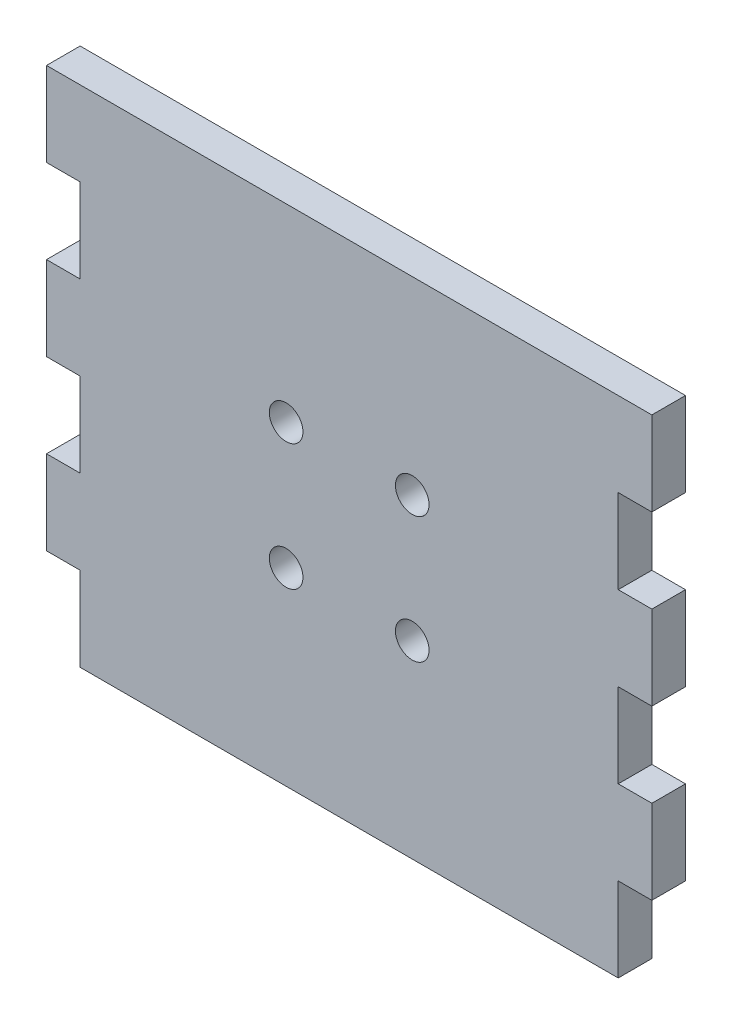
ISO-10303-21;
HEADER;
FILE_DESCRIPTION(('STEP AP214'),'2;1');
FILE_NAME('part.step','',(''),(''),'','','');
FILE_SCHEMA(('AUTOMOTIVE_DESIGN { 1 0 10303 214 1 1 1 1 }'));
ENDSEC;
DATA;
#1=APPLICATION_CONTEXT('core data for automotive mechanical design processes');
#2=APPLICATION_PROTOCOL_DEFINITION('international standard','automotive_design',2000,#1);
#3=PRODUCT_CONTEXT('',#1,'mechanical');
#4=PRODUCT('Part','Part','',(#3));
#5=PRODUCT_RELATED_PRODUCT_CATEGORY('part','',(#4));
#6=PRODUCT_DEFINITION_FORMATION('','',#4);
#7=PRODUCT_DEFINITION_CONTEXT('part definition',#1,'design');
#8=PRODUCT_DEFINITION('design','',#6,#7);
#9=PRODUCT_DEFINITION_SHAPE('','',#8);
#10=(LENGTH_UNIT() NAMED_UNIT(*) SI_UNIT(.MILLI.,.METRE.));
#11=(NAMED_UNIT(*) PLANE_ANGLE_UNIT() SI_UNIT($,.RADIAN.));
#12=(NAMED_UNIT(*) SI_UNIT($,.STERADIAN.) SOLID_ANGLE_UNIT());
#13=UNCERTAINTY_MEASURE_WITH_UNIT(LENGTH_MEASURE(1.E-05),#10,'distance_accuracy_value','');
#14=(GEOMETRIC_REPRESENTATION_CONTEXT(3) GLOBAL_UNCERTAINTY_ASSIGNED_CONTEXT((#13)) GLOBAL_UNIT_ASSIGNED_CONTEXT((#10,
#11,#12)) REPRESENTATION_CONTEXT('',''));
#15=CARTESIAN_POINT('',(0.,0.,0.));
#16=DIRECTION('',(0.,0.,1.));
#17=DIRECTION('',(1.,0.,0.));
#18=AXIS2_PLACEMENT_3D('',#15,#16,#17);
#19=CARTESIAN_POINT('',(0.,0.,4.));
#20=DIRECTION('',(0.,0.,1.));
#21=DIRECTION('',(1.,0.,0.));
#22=AXIS2_PLACEMENT_3D('',#19,#20,#21);
#23=PLANE('',#22);
#24=CARTESIAN_POINT('',(7.5,-7.5,4.));
#25=DIRECTION('',(0.,0.,1.));
#26=DIRECTION('',(1.,0.,0.));
#27=AXIS2_PLACEMENT_3D('',#24,#25,#26);
#28=CIRCLE('',#27,2.);
#29=CARTESIAN_POINT('',(9.5,-7.5,4.));
#30=VERTEX_POINT('',#29);
#31=EDGE_CURVE('E449',#30,#30,#28,.T.);
#32=ORIENTED_EDGE('',*,*,#31,.F.);
#33=EDGE_LOOP('',(#32));
#34=FACE_BOUND('',#33,.T.);
#35=CARTESIAN_POINT('',(-7.5,7.5,4.));
#36=DIRECTION('',(0.,0.,1.));
#37=DIRECTION('',(1.,0.,0.));
#38=AXIS2_PLACEMENT_3D('',#35,#36,#37);
#39=CIRCLE('',#38,2.);
#40=CARTESIAN_POINT('',(-5.5,7.5,4.));
#41=VERTEX_POINT('',#40);
#42=EDGE_CURVE('E232',#41,#41,#39,.T.);
#43=ORIENTED_EDGE('',*,*,#42,.F.);
#44=EDGE_LOOP('',(#43));
#45=FACE_BOUND('',#44,.T.);
#46=DIRECTION('',(0.,-1.,0.));
#47=VECTOR('',#46,1.);
#48=CARTESIAN_POINT('',(-36.,30.,4.));
#49=LINE('',#48,#47);
#50=CARTESIAN_POINT('',(-36.,30.,4.));
#51=VERTEX_POINT('',#50);
#52=CARTESIAN_POINT('',(-36.,20.,4.));
#53=VERTEX_POINT('',#52);
#54=EDGE_CURVE('E275',#51,#53,#49,.T.);
#55=ORIENTED_EDGE('',*,*,#54,.T.);
#56=DIRECTION('',(1.,0.,0.));
#57=VECTOR('',#56,1.);
#58=CARTESIAN_POINT('',(-36.,20.,4.));
#59=LINE('',#58,#57);
#60=CARTESIAN_POINT('',(-32.,20.,4.));
#61=VERTEX_POINT('',#60);
#62=EDGE_CURVE('E143',#53,#61,#59,.T.);
#63=ORIENTED_EDGE('',*,*,#62,.T.);
#64=DIRECTION('',(0.,-1.,0.));
#65=VECTOR('',#64,1.);
#66=CARTESIAN_POINT('',(-32.,20.,4.));
#67=LINE('',#66,#65);
#68=CARTESIAN_POINT('',(-32.,9.99999999999999,4.));
#69=VERTEX_POINT('',#68);
#70=EDGE_CURVE('E338',#61,#69,#67,.T.);
#71=ORIENTED_EDGE('',*,*,#70,.T.);
#72=DIRECTION('',(-1.,0.,0.));
#73=VECTOR('',#72,1.);
#74=CARTESIAN_POINT('',(-32.,9.99999999999999,4.));
#75=LINE('',#74,#73);
#76=CARTESIAN_POINT('',(-36.,9.99999999999999,4.));
#77=VERTEX_POINT('',#76);
#78=EDGE_CURVE('E357',#69,#77,#75,.T.);
#79=ORIENTED_EDGE('',*,*,#78,.T.);
#80=DIRECTION('',(0.,-1.,0.));
#81=VECTOR('',#80,1.);
#82=CARTESIAN_POINT('',(-36.,9.99999999999999,4.));
#83=LINE('',#82,#81);
#84=CARTESIAN_POINT('',(-36.,0.,4.));
#85=VERTEX_POINT('',#84);
#86=EDGE_CURVE('E354',#77,#85,#83,.T.);
#87=ORIENTED_EDGE('',*,*,#86,.T.);
#88=DIRECTION('',(1.,0.,0.));
#89=VECTOR('',#88,1.);
#90=CARTESIAN_POINT('',(-36.,0.,4.));
#91=LINE('',#90,#89);
#92=CARTESIAN_POINT('',(-32.,0.,4.));
#93=VERTEX_POINT('',#92);
#94=EDGE_CURVE('E356',#85,#93,#91,.T.);
#95=ORIENTED_EDGE('',*,*,#94,.T.);
#96=DIRECTION('',(0.,-1.,0.));
#97=VECTOR('',#96,1.);
#98=CARTESIAN_POINT('',(-32.,0.,4.));
#99=LINE('',#98,#97);
#100=CARTESIAN_POINT('',(-32.,-10.,4.));
#101=VERTEX_POINT('',#100);
#102=EDGE_CURVE('E359',#93,#101,#99,.T.);
#103=ORIENTED_EDGE('',*,*,#102,.T.);
#104=DIRECTION('',(-1.,0.,0.));
#105=VECTOR('',#104,1.);
#106=CARTESIAN_POINT('',(-32.,-10.,4.));
#107=LINE('',#106,#105);
#108=CARTESIAN_POINT('',(-36.,-10.,4.));
#109=VERTEX_POINT('',#108);
#110=EDGE_CURVE('E365',#101,#109,#107,.T.);
#111=ORIENTED_EDGE('',*,*,#110,.T.);
#112=DIRECTION('',(0.,-1.,0.));
#113=VECTOR('',#112,1.);
#114=CARTESIAN_POINT('',(-36.,-10.,4.));
#115=LINE('',#114,#113);
#116=CARTESIAN_POINT('',(-36.,-20.,4.));
#117=VERTEX_POINT('',#116);
#118=EDGE_CURVE('E367',#109,#117,#115,.T.);
#119=ORIENTED_EDGE('',*,*,#118,.T.);
#120=DIRECTION('',(1.,0.,0.));
#121=VECTOR('',#120,1.);
#122=CARTESIAN_POINT('',(-36.,-20.,4.));
#123=LINE('',#122,#121);
#124=CARTESIAN_POINT('',(-32.,-20.,4.));
#125=VERTEX_POINT('',#124);
#126=EDGE_CURVE('E369',#117,#125,#123,.T.);
#127=ORIENTED_EDGE('',*,*,#126,.T.);
#128=DIRECTION('',(0.,-1.,0.));
#129=VECTOR('',#128,1.);
#130=CARTESIAN_POINT('',(-32.,-20.,4.));
#131=LINE('',#130,#129);
#132=CARTESIAN_POINT('',(-32.,-30.,4.));
#133=VERTEX_POINT('',#132);
#134=EDGE_CURVE('E371',#125,#133,#131,.T.);
#135=ORIENTED_EDGE('',*,*,#134,.T.);
#136=DIRECTION('',(1.,0.,0.));
#137=VECTOR('',#136,1.);
#138=CARTESIAN_POINT('',(-32.,-30.,4.));
#139=LINE('',#138,#137);
#140=CARTESIAN_POINT('',(32.,-30.,4.));
#141=VERTEX_POINT('',#140);
#142=EDGE_CURVE('E373',#133,#141,#139,.T.);
#143=ORIENTED_EDGE('',*,*,#142,.T.);
#144=DIRECTION('',(0.,1.,0.));
#145=VECTOR('',#144,1.);
#146=CARTESIAN_POINT('',(32.,-20.,4.));
#147=LINE('',#146,#145);
#148=CARTESIAN_POINT('',(32.,-20.,4.));
#149=VERTEX_POINT('',#148);
#150=EDGE_CURVE('E375',#141,#149,#147,.T.);
#151=ORIENTED_EDGE('',*,*,#150,.T.);
#152=DIRECTION('',(1.,0.,0.));
#153=VECTOR('',#152,1.);
#154=CARTESIAN_POINT('',(36.,-20.,4.));
#155=LINE('',#154,#153);
#156=CARTESIAN_POINT('',(36.,-20.,4.));
#157=VERTEX_POINT('',#156);
#158=EDGE_CURVE('E377',#149,#157,#155,.T.);
#159=ORIENTED_EDGE('',*,*,#158,.T.);
#160=DIRECTION('',(0.,1.,0.));
#161=VECTOR('',#160,1.);
#162=CARTESIAN_POINT('',(36.,-10.,4.));
#163=LINE('',#162,#161);
#164=CARTESIAN_POINT('',(36.,-10.,4.));
#165=VERTEX_POINT('',#164);
#166=EDGE_CURVE('E379',#157,#165,#163,.T.);
#167=ORIENTED_EDGE('',*,*,#166,.T.);
#168=DIRECTION('',(-1.,0.,0.));
#169=VECTOR('',#168,1.);
#170=CARTESIAN_POINT('',(32.,-10.,4.));
#171=LINE('',#170,#169);
#172=CARTESIAN_POINT('',(32.,-10.,4.));
#173=VERTEX_POINT('',#172);
#174=EDGE_CURVE('E381',#165,#173,#171,.T.);
#175=ORIENTED_EDGE('',*,*,#174,.T.);
#176=DIRECTION('',(0.,1.,0.));
#177=VECTOR('',#176,1.);
#178=CARTESIAN_POINT('',(32.,0.,4.));
#179=LINE('',#178,#177);
#180=CARTESIAN_POINT('',(32.,0.,4.));
#181=VERTEX_POINT('',#180);
#182=EDGE_CURVE('E383',#173,#181,#179,.T.);
#183=ORIENTED_EDGE('',*,*,#182,.T.);
#184=DIRECTION('',(1.,0.,0.));
#185=VECTOR('',#184,1.);
#186=CARTESIAN_POINT('',(36.,0.,4.));
#187=LINE('',#186,#185);
#188=CARTESIAN_POINT('',(36.,0.,4.));
#189=VERTEX_POINT('',#188);
#190=EDGE_CURVE('E385',#181,#189,#187,.T.);
#191=ORIENTED_EDGE('',*,*,#190,.T.);
#192=DIRECTION('',(0.,1.,0.));
#193=VECTOR('',#192,1.);
#194=CARTESIAN_POINT('',(36.,9.99999999999999,4.));
#195=LINE('',#194,#193);
#196=CARTESIAN_POINT('',(36.,9.99999999999999,4.));
#197=VERTEX_POINT('',#196);
#198=EDGE_CURVE('E387',#189,#197,#195,.T.);
#199=ORIENTED_EDGE('',*,*,#198,.T.);
#200=DIRECTION('',(-1.,0.,0.));
#201=VECTOR('',#200,1.);
#202=CARTESIAN_POINT('',(32.,9.99999999999999,4.));
#203=LINE('',#202,#201);
#204=CARTESIAN_POINT('',(32.,9.99999999999999,4.));
#205=VERTEX_POINT('',#204);
#206=EDGE_CURVE('E389',#197,#205,#203,.T.);
#207=ORIENTED_EDGE('',*,*,#206,.T.);
#208=DIRECTION('',(0.,1.,0.));
#209=VECTOR('',#208,1.);
#210=CARTESIAN_POINT('',(32.,20.,4.));
#211=LINE('',#210,#209);
#212=CARTESIAN_POINT('',(32.,20.,4.));
#213=VERTEX_POINT('',#212);
#214=EDGE_CURVE('E210',#205,#213,#211,.T.);
#215=ORIENTED_EDGE('',*,*,#214,.T.);
#216=DIRECTION('',(1.,0.,0.));
#217=VECTOR('',#216,1.);
#218=CARTESIAN_POINT('',(36.,20.,4.));
#219=LINE('',#218,#217);
#220=CARTESIAN_POINT('',(36.,20.,4.));
#221=VERTEX_POINT('',#220);
#222=EDGE_CURVE('E204',#213,#221,#219,.T.);
#223=ORIENTED_EDGE('',*,*,#222,.T.);
#224=DIRECTION('',(0.,1.,0.));
#225=VECTOR('',#224,1.);
#226=CARTESIAN_POINT('',(36.,30.,4.));
#227=LINE('',#226,#225);
#228=CARTESIAN_POINT('',(36.,30.,4.));
#229=VERTEX_POINT('',#228);
#230=EDGE_CURVE('E208',#221,#229,#227,.T.);
#231=ORIENTED_EDGE('',*,*,#230,.T.);
#232=DIRECTION('',(-1.,0.,0.));
#233=VECTOR('',#232,1.);
#234=CARTESIAN_POINT('',(-36.,30.,4.));
#235=LINE('',#234,#233);
#236=EDGE_CURVE('E52',#229,#51,#235,.T.);
#237=ORIENTED_EDGE('',*,*,#236,.T.);
#238=EDGE_LOOP('',(#55,#63,#71,#79,#87,#95,#103,#111,#119,#127,#135,#143,#151,#159,#167,#175,
#183,#191,#199,#207,#215,#223,#231,#237));
#239=FACE_BOUND('',#238,.T.);
#240=CARTESIAN_POINT('',(-7.5,-7.5,4.));
#241=DIRECTION('',(0.,0.,1.));
#242=DIRECTION('',(1.,0.,0.));
#243=AXIS2_PLACEMENT_3D('',#240,#241,#242);
#244=CIRCLE('',#243,2.);
#245=CARTESIAN_POINT('',(-5.5,-7.5,4.));
#246=VERTEX_POINT('',#245);
#247=EDGE_CURVE('E455',#246,#246,#244,.T.);
#248=ORIENTED_EDGE('',*,*,#247,.F.);
#249=EDGE_LOOP('',(#248));
#250=FACE_BOUND('',#249,.T.);
#251=CARTESIAN_POINT('',(7.5,7.5,4.));
#252=DIRECTION('',(0.,0.,1.));
#253=DIRECTION('',(1.,0.,0.));
#254=AXIS2_PLACEMENT_3D('',#251,#252,#253);
#255=CIRCLE('',#254,2.);
#256=CARTESIAN_POINT('',(9.5,7.5,4.));
#257=VERTEX_POINT('',#256);
#258=EDGE_CURVE('E440',#257,#257,#255,.T.);
#259=ORIENTED_EDGE('',*,*,#258,.F.);
#260=EDGE_LOOP('',(#259));
#261=FACE_BOUND('',#260,.T.);
#262=ADVANCED_FACE('F35',(#34,#45,#239,#250,#261),#23,.T.);
#263=CARTESIAN_POINT('',(0.,0.,0.));
#264=DIRECTION('',(0.,0.,1.));
#265=DIRECTION('',(1.,0.,0.));
#266=AXIS2_PLACEMENT_3D('',#263,#264,#265);
#267=PLANE('',#266);
#268=DIRECTION('',(0.,-1.,0.));
#269=VECTOR('',#268,1.);
#270=CARTESIAN_POINT('',(-36.,30.,0.));
#271=LINE('',#270,#269);
#272=CARTESIAN_POINT('',(-36.,30.,0.));
#273=VERTEX_POINT('',#272);
#274=CARTESIAN_POINT('',(-36.,20.,0.));
#275=VERTEX_POINT('',#274);
#276=EDGE_CURVE('E228',#273,#275,#271,.T.);
#277=ORIENTED_EDGE('',*,*,#276,.F.);
#278=DIRECTION('',(-1.,0.,0.));
#279=VECTOR('',#278,1.);
#280=CARTESIAN_POINT('',(-36.,30.,0.));
#281=LINE('',#280,#279);
#282=CARTESIAN_POINT('',(36.,30.,0.));
#283=VERTEX_POINT('',#282);
#284=EDGE_CURVE('E135',#283,#273,#281,.T.);
#285=ORIENTED_EDGE('',*,*,#284,.F.);
#286=DIRECTION('',(0.,1.,0.));
#287=VECTOR('',#286,1.);
#288=CARTESIAN_POINT('',(36.,30.,0.));
#289=LINE('',#288,#287);
#290=CARTESIAN_POINT('',(36.,20.,0.));
#291=VERTEX_POINT('',#290);
#292=EDGE_CURVE('E129',#291,#283,#289,.T.);
#293=ORIENTED_EDGE('',*,*,#292,.F.);
#294=DIRECTION('',(1.,0.,0.));
#295=VECTOR('',#294,1.);
#296=CARTESIAN_POINT('',(36.,20.,0.));
#297=LINE('',#296,#295);
#298=CARTESIAN_POINT('',(32.,20.,0.));
#299=VERTEX_POINT('',#298);
#300=EDGE_CURVE('E218',#299,#291,#297,.T.);
#301=ORIENTED_EDGE('',*,*,#300,.F.);
#302=DIRECTION('',(0.,1.,0.));
#303=VECTOR('',#302,1.);
#304=CARTESIAN_POINT('',(32.,20.,0.));
#305=LINE('',#304,#303);
#306=CARTESIAN_POINT('',(32.,9.99999999999999,0.));
#307=VERTEX_POINT('',#306);
#308=EDGE_CURVE('E270',#307,#299,#305,.T.);
#309=ORIENTED_EDGE('',*,*,#308,.F.);
#310=DIRECTION('',(-1.,0.,0.));
#311=VECTOR('',#310,1.);
#312=CARTESIAN_POINT('',(32.,9.99999999999999,0.));
#313=LINE('',#312,#311);
#314=CARTESIAN_POINT('',(36.,9.99999999999999,0.));
#315=VERTEX_POINT('',#314);
#316=EDGE_CURVE('E268',#315,#307,#313,.T.);
#317=ORIENTED_EDGE('',*,*,#316,.F.);
#318=DIRECTION('',(0.,1.,0.));
#319=VECTOR('',#318,1.);
#320=CARTESIAN_POINT('',(36.,9.99999999999999,0.));
#321=LINE('',#320,#319);
#322=CARTESIAN_POINT('',(36.,0.,0.));
#323=VERTEX_POINT('',#322);
#324=EDGE_CURVE('E266',#323,#315,#321,.T.);
#325=ORIENTED_EDGE('',*,*,#324,.F.);
#326=DIRECTION('',(1.,0.,0.));
#327=VECTOR('',#326,1.);
#328=CARTESIAN_POINT('',(36.,0.,0.));
#329=LINE('',#328,#327);
#330=CARTESIAN_POINT('',(32.,0.,0.));
#331=VERTEX_POINT('',#330);
#332=EDGE_CURVE('E264',#331,#323,#329,.T.);
#333=ORIENTED_EDGE('',*,*,#332,.F.);
#334=DIRECTION('',(0.,1.,0.));
#335=VECTOR('',#334,1.);
#336=CARTESIAN_POINT('',(32.,0.,0.));
#337=LINE('',#336,#335);
#338=CARTESIAN_POINT('',(32.,-10.,0.));
#339=VERTEX_POINT('',#338);
#340=EDGE_CURVE('E262',#339,#331,#337,.T.);
#341=ORIENTED_EDGE('',*,*,#340,.F.);
#342=DIRECTION('',(-1.,0.,0.));
#343=VECTOR('',#342,1.);
#344=CARTESIAN_POINT('',(32.,-10.,0.));
#345=LINE('',#344,#343);
#346=CARTESIAN_POINT('',(36.,-10.,0.));
#347=VERTEX_POINT('',#346);
#348=EDGE_CURVE('E260',#347,#339,#345,.T.);
#349=ORIENTED_EDGE('',*,*,#348,.F.);
#350=DIRECTION('',(0.,1.,0.));
#351=VECTOR('',#350,1.);
#352=CARTESIAN_POINT('',(36.,-10.,0.));
#353=LINE('',#352,#351);
#354=CARTESIAN_POINT('',(36.,-20.,0.));
#355=VERTEX_POINT('',#354);
#356=EDGE_CURVE('E258',#355,#347,#353,.T.);
#357=ORIENTED_EDGE('',*,*,#356,.F.);
#358=DIRECTION('',(1.,0.,0.));
#359=VECTOR('',#358,1.);
#360=CARTESIAN_POINT('',(36.,-20.,0.));
#361=LINE('',#360,#359);
#362=CARTESIAN_POINT('',(32.,-20.,0.));
#363=VERTEX_POINT('',#362);
#364=EDGE_CURVE('E256',#363,#355,#361,.T.);
#365=ORIENTED_EDGE('',*,*,#364,.F.);
#366=DIRECTION('',(0.,1.,0.));
#367=VECTOR('',#366,1.);
#368=CARTESIAN_POINT('',(32.,-20.,0.));
#369=LINE('',#368,#367);
#370=CARTESIAN_POINT('',(32.,-30.,0.));
#371=VERTEX_POINT('',#370);
#372=EDGE_CURVE('E254',#371,#363,#369,.T.);
#373=ORIENTED_EDGE('',*,*,#372,.F.);
#374=DIRECTION('',(1.,0.,0.));
#375=VECTOR('',#374,1.);
#376=CARTESIAN_POINT('',(-32.,-30.,0.));
#377=LINE('',#376,#375);
#378=CARTESIAN_POINT('',(-32.,-30.,0.));
#379=VERTEX_POINT('',#378);
#380=EDGE_CURVE('E252',#379,#371,#377,.T.);
#381=ORIENTED_EDGE('',*,*,#380,.F.);
#382=DIRECTION('',(0.,-1.,0.));
#383=VECTOR('',#382,1.);
#384=CARTESIAN_POINT('',(-32.,-20.,0.));
#385=LINE('',#384,#383);
#386=CARTESIAN_POINT('',(-32.,-20.,0.));
#387=VERTEX_POINT('',#386);
#388=EDGE_CURVE('E250',#387,#379,#385,.T.);
#389=ORIENTED_EDGE('',*,*,#388,.F.);
#390=DIRECTION('',(1.,0.,0.));
#391=VECTOR('',#390,1.);
#392=CARTESIAN_POINT('',(-36.,-20.,0.));
#393=LINE('',#392,#391);
#394=CARTESIAN_POINT('',(-36.,-20.,0.));
#395=VERTEX_POINT('',#394);
#396=EDGE_CURVE('E248',#395,#387,#393,.T.);
#397=ORIENTED_EDGE('',*,*,#396,.F.);
#398=DIRECTION('',(0.,-1.,0.));
#399=VECTOR('',#398,1.);
#400=CARTESIAN_POINT('',(-36.,-10.,0.));
#401=LINE('',#400,#399);
#402=CARTESIAN_POINT('',(-36.,-10.,0.));
#403=VERTEX_POINT('',#402);
#404=EDGE_CURVE('E246',#403,#395,#401,.T.);
#405=ORIENTED_EDGE('',*,*,#404,.F.);
#406=DIRECTION('',(-1.,0.,0.));
#407=VECTOR('',#406,1.);
#408=CARTESIAN_POINT('',(-32.,-10.,0.));
#409=LINE('',#408,#407);
#410=CARTESIAN_POINT('',(-32.,-10.,0.));
#411=VERTEX_POINT('',#410);
#412=EDGE_CURVE('E244',#411,#403,#409,.T.);
#413=ORIENTED_EDGE('',*,*,#412,.F.);
#414=DIRECTION('',(0.,-1.,0.));
#415=VECTOR('',#414,1.);
#416=CARTESIAN_POINT('',(-32.,0.,0.));
#417=LINE('',#416,#415);
#418=CARTESIAN_POINT('',(-32.,0.,0.));
#419=VERTEX_POINT('',#418);
#420=EDGE_CURVE('E242',#419,#411,#417,.T.);
#421=ORIENTED_EDGE('',*,*,#420,.F.);
#422=DIRECTION('',(1.,0.,0.));
#423=VECTOR('',#422,1.);
#424=CARTESIAN_POINT('',(-36.,0.,0.));
#425=LINE('',#424,#423);
#426=CARTESIAN_POINT('',(-36.,0.,0.));
#427=VERTEX_POINT('',#426);
#428=EDGE_CURVE('E240',#427,#419,#425,.T.);
#429=ORIENTED_EDGE('',*,*,#428,.F.);
#430=DIRECTION('',(0.,-1.,0.));
#431=VECTOR('',#430,1.);
#432=CARTESIAN_POINT('',(-36.,9.99999999999999,0.));
#433=LINE('',#432,#431);
#434=CARTESIAN_POINT('',(-36.,9.99999999999999,0.));
#435=VERTEX_POINT('',#434);
#436=EDGE_CURVE('E238',#435,#427,#433,.T.);
#437=ORIENTED_EDGE('',*,*,#436,.F.);
#438=DIRECTION('',(-1.,0.,0.));
#439=VECTOR('',#438,1.);
#440=CARTESIAN_POINT('',(-32.,9.99999999999999,0.));
#441=LINE('',#440,#439);
#442=CARTESIAN_POINT('',(-32.,9.99999999999999,0.));
#443=VERTEX_POINT('',#442);
#444=EDGE_CURVE('E236',#443,#435,#441,.T.);
#445=ORIENTED_EDGE('',*,*,#444,.F.);
#446=DIRECTION('',(0.,-1.,0.));
#447=VECTOR('',#446,1.);
#448=CARTESIAN_POINT('',(-32.,20.,0.));
#449=LINE('',#448,#447);
#450=CARTESIAN_POINT('',(-32.,20.,0.));
#451=VERTEX_POINT('',#450);
#452=EDGE_CURVE('E234',#451,#443,#449,.T.);
#453=ORIENTED_EDGE('',*,*,#452,.F.);
#454=DIRECTION('',(1.,0.,0.));
#455=VECTOR('',#454,1.);
#456=CARTESIAN_POINT('',(-36.,20.,0.));
#457=LINE('',#456,#455);
#458=EDGE_CURVE('E231',#275,#451,#457,.T.);
#459=ORIENTED_EDGE('',*,*,#458,.F.);
#460=EDGE_LOOP('',(#277,#285,#293,#301,#309,#317,#325,#333,#341,#349,#357,#365,#373,#381,#389,
#397,#405,#413,#421,#429,#437,#445,#453,#459));
#461=FACE_BOUND('',#460,.T.);
#462=CARTESIAN_POINT('',(-7.5,7.5,0.));
#463=DIRECTION('',(0.,0.,1.));
#464=DIRECTION('',(1.,0.,0.));
#465=AXIS2_PLACEMENT_3D('',#462,#463,#464);
#466=CIRCLE('',#465,2.);
#467=CARTESIAN_POINT('',(-5.5,7.5,0.));
#468=VERTEX_POINT('',#467);
#469=EDGE_CURVE('E458',#468,#468,#466,.T.);
#470=ORIENTED_EDGE('',*,*,#469,.T.);
#471=EDGE_LOOP('',(#470));
#472=FACE_BOUND('',#471,.T.);
#473=CARTESIAN_POINT('',(-7.5,-7.5,0.));
#474=DIRECTION('',(0.,0.,1.));
#475=DIRECTION('',(1.,0.,0.));
#476=AXIS2_PLACEMENT_3D('',#473,#474,#475);
#477=CIRCLE('',#476,2.);
#478=CARTESIAN_POINT('',(-5.5,-7.5,0.));
#479=VERTEX_POINT('',#478);
#480=EDGE_CURVE('E452',#479,#479,#477,.T.);
#481=ORIENTED_EDGE('',*,*,#480,.T.);
#482=EDGE_LOOP('',(#481));
#483=FACE_BOUND('',#482,.T.);
#484=CARTESIAN_POINT('',(7.5,-7.5,0.));
#485=DIRECTION('',(0.,0.,1.));
#486=DIRECTION('',(1.,0.,0.));
#487=AXIS2_PLACEMENT_3D('',#484,#485,#486);
#488=CIRCLE('',#487,2.);
#489=CARTESIAN_POINT('',(9.5,-7.5,0.));
#490=VERTEX_POINT('',#489);
#491=EDGE_CURVE('E446',#490,#490,#488,.T.);
#492=ORIENTED_EDGE('',*,*,#491,.T.);
#493=EDGE_LOOP('',(#492));
#494=FACE_BOUND('',#493,.T.);
#495=CARTESIAN_POINT('',(7.5,7.5,0.));
#496=DIRECTION('',(0.,0.,1.));
#497=DIRECTION('',(1.,0.,0.));
#498=AXIS2_PLACEMENT_3D('',#495,#496,#497);
#499=CIRCLE('',#498,2.);
#500=CARTESIAN_POINT('',(9.5,7.5,0.));
#501=VERTEX_POINT('',#500);
#502=EDGE_CURVE('E443',#501,#501,#499,.T.);
#503=ORIENTED_EDGE('',*,*,#502,.T.);
#504=EDGE_LOOP('',(#503));
#505=FACE_BOUND('',#504,.T.);
#506=ADVANCED_FACE('F342',(#461,#472,#483,#494,#505),#267,.F.);
#507=CARTESIAN_POINT('',(-36.,30.,4.));
#508=DIRECTION('',(1.,0.,0.));
#509=DIRECTION('',(0.,0.,-1.));
#510=AXIS2_PLACEMENT_3D('',#507,#508,#509);
#511=PLANE('',#510);
#512=ORIENTED_EDGE('',*,*,#276,.T.);
#513=DIRECTION('',(0.,0.,-1.));
#514=VECTOR('',#513,1.);
#515=CARTESIAN_POINT('',(-36.,20.,4.));
#516=LINE('',#515,#514);
#517=EDGE_CURVE('E11',#53,#275,#516,.T.);
#518=ORIENTED_EDGE('',*,*,#517,.F.);
#519=ORIENTED_EDGE('',*,*,#54,.F.);
#520=DIRECTION('',(0.,0.,-1.));
#521=VECTOR('',#520,1.);
#522=CARTESIAN_POINT('',(-36.,30.,4.));
#523=LINE('',#522,#521);
#524=EDGE_CURVE('E224',#51,#273,#523,.T.);
#525=ORIENTED_EDGE('',*,*,#524,.T.);
#526=EDGE_LOOP('',(#512,#518,#519,#525));
#527=FACE_BOUND('',#526,.T.);
#528=ADVANCED_FACE('F37',(#527),#511,.F.);
#529=CARTESIAN_POINT('',(-36.,20.,4.));
#530=DIRECTION('',(0.,1.,0.));
#531=DIRECTION('',(0.,0.,1.));
#532=AXIS2_PLACEMENT_3D('',#529,#530,#531);
#533=PLANE('',#532);
#534=ORIENTED_EDGE('',*,*,#458,.T.);
#535=DIRECTION('',(0.,0.,-1.));
#536=VECTOR('',#535,1.);
#537=CARTESIAN_POINT('',(-32.,20.,4.));
#538=LINE('',#537,#536);
#539=EDGE_CURVE('E44',#61,#451,#538,.T.);
#540=ORIENTED_EDGE('',*,*,#539,.F.);
#541=ORIENTED_EDGE('',*,*,#62,.F.);
#542=ORIENTED_EDGE('',*,*,#517,.T.);
#543=EDGE_LOOP('',(#534,#540,#541,#542));
#544=FACE_BOUND('',#543,.T.);
#545=ADVANCED_FACE('F688',(#544),#533,.F.);
#546=CARTESIAN_POINT('',(-32.,20.,4.));
#547=DIRECTION('',(1.,0.,0.));
#548=DIRECTION('',(0.,0.,-1.));
#549=AXIS2_PLACEMENT_3D('',#546,#547,#548);
#550=PLANE('',#549);
#551=ORIENTED_EDGE('',*,*,#452,.T.);
#552=DIRECTION('',(0.,0.,-1.));
#553=VECTOR('',#552,1.);
#554=CARTESIAN_POINT('',(-32.,9.99999999999999,4.));
#555=LINE('',#554,#553);
#556=EDGE_CURVE('E330',#69,#443,#555,.T.);
#557=ORIENTED_EDGE('',*,*,#556,.F.);
#558=ORIENTED_EDGE('',*,*,#70,.F.);
#559=ORIENTED_EDGE('',*,*,#539,.T.);
#560=EDGE_LOOP('',(#551,#557,#558,#559));
#561=FACE_BOUND('',#560,.T.);
#562=ADVANCED_FACE('F336',(#561),#550,.F.);
#563=CARTESIAN_POINT('',(-32.,9.99999999999999,4.));
#564=DIRECTION('',(0.,-1.,0.));
#565=DIRECTION('',(1.,0.,0.));
#566=AXIS2_PLACEMENT_3D('',#563,#564,#565);
#567=PLANE('',#566);
#568=ORIENTED_EDGE('',*,*,#444,.T.);
#569=DIRECTION('',(0.,0.,-1.));
#570=VECTOR('',#569,1.);
#571=CARTESIAN_POINT('',(-36.,9.99999999999999,4.));
#572=LINE('',#571,#570);
#573=EDGE_CURVE('E327',#77,#435,#572,.T.);
#574=ORIENTED_EDGE('',*,*,#573,.F.);
#575=ORIENTED_EDGE('',*,*,#78,.F.);
#576=ORIENTED_EDGE('',*,*,#556,.T.);
#577=EDGE_LOOP('',(#568,#574,#575,#576));
#578=FACE_BOUND('',#577,.T.);
#579=ADVANCED_FACE('F348',(#578),#567,.F.);
#580=CARTESIAN_POINT('',(-36.,9.99999999999999,4.));
#581=DIRECTION('',(1.,0.,0.));
#582=DIRECTION('',(0.,1.,0.));
#583=AXIS2_PLACEMENT_3D('',#580,#581,#582);
#584=PLANE('',#583);
#585=ORIENTED_EDGE('',*,*,#436,.T.);
#586=DIRECTION('',(0.,0.,-1.));
#587=VECTOR('',#586,1.);
#588=CARTESIAN_POINT('',(-36.,0.,4.));
#589=LINE('',#588,#587);
#590=EDGE_CURVE('E324',#85,#427,#589,.T.);
#591=ORIENTED_EDGE('',*,*,#590,.F.);
#592=ORIENTED_EDGE('',*,*,#86,.F.);
#593=ORIENTED_EDGE('',*,*,#573,.T.);
#594=EDGE_LOOP('',(#585,#591,#592,#593));
#595=FACE_BOUND('',#594,.T.);
#596=ADVANCED_FACE('F352',(#595),#584,.F.);
#597=CARTESIAN_POINT('',(-36.,0.,4.));
#598=DIRECTION('',(0.,1.,0.));
#599=DIRECTION('',(-1.,0.,0.));
#600=AXIS2_PLACEMENT_3D('',#597,#598,#599);
#601=PLANE('',#600);
#602=ORIENTED_EDGE('',*,*,#428,.T.);
#603=DIRECTION('',(0.,0.,-1.));
#604=VECTOR('',#603,1.);
#605=CARTESIAN_POINT('',(-32.,0.,4.));
#606=LINE('',#605,#604);
#607=EDGE_CURVE('E321',#93,#419,#606,.T.);
#608=ORIENTED_EDGE('',*,*,#607,.F.);
#609=ORIENTED_EDGE('',*,*,#94,.F.);
#610=ORIENTED_EDGE('',*,*,#590,.T.);
#611=EDGE_LOOP('',(#602,#608,#609,#610));
#612=FACE_BOUND('',#611,.T.);
#613=ADVANCED_FACE('F653',(#612),#601,.F.);
#614=CARTESIAN_POINT('',(-32.,0.,4.));
#615=DIRECTION('',(1.,0.,0.));
#616=DIRECTION('',(0.,0.,-1.));
#617=AXIS2_PLACEMENT_3D('',#614,#615,#616);
#618=PLANE('',#617);
#619=ORIENTED_EDGE('',*,*,#420,.T.);
#620=DIRECTION('',(0.,0.,-1.));
#621=VECTOR('',#620,1.);
#622=CARTESIAN_POINT('',(-32.,-10.,4.));
#623=LINE('',#622,#621);
#624=EDGE_CURVE('E318',#101,#411,#623,.T.);
#625=ORIENTED_EDGE('',*,*,#624,.F.);
#626=ORIENTED_EDGE('',*,*,#102,.F.);
#627=ORIENTED_EDGE('',*,*,#607,.T.);
#628=EDGE_LOOP('',(#619,#625,#626,#627));
#629=FACE_BOUND('',#628,.T.);
#630=ADVANCED_FACE('F643',(#629),#618,.F.);
#631=CARTESIAN_POINT('',(-32.,-10.,4.));
#632=DIRECTION('',(0.,-1.,0.));
#633=DIRECTION('',(1.,0.,0.));
#634=AXIS2_PLACEMENT_3D('',#631,#632,#633);
#635=PLANE('',#634);
#636=ORIENTED_EDGE('',*,*,#412,.T.);
#637=DIRECTION('',(0.,0.,-1.));
#638=VECTOR('',#637,1.);
#639=CARTESIAN_POINT('',(-36.,-10.,4.));
#640=LINE('',#639,#638);
#641=EDGE_CURVE('E315',#109,#403,#640,.T.);
#642=ORIENTED_EDGE('',*,*,#641,.F.);
#643=ORIENTED_EDGE('',*,*,#110,.F.);
#644=ORIENTED_EDGE('',*,*,#624,.T.);
#645=EDGE_LOOP('',(#636,#642,#643,#644));
#646=FACE_BOUND('',#645,.T.);
#647=ADVANCED_FACE('F633',(#646),#635,.F.);
#648=CARTESIAN_POINT('',(-36.,-10.,4.));
#649=DIRECTION('',(1.,0.,0.));
#650=DIRECTION('',(0.,0.,-1.));
#651=AXIS2_PLACEMENT_3D('',#648,#649,#650);
#652=PLANE('',#651);
#653=ORIENTED_EDGE('',*,*,#404,.T.);
#654=DIRECTION('',(0.,0.,-1.));
#655=VECTOR('',#654,1.);
#656=CARTESIAN_POINT('',(-36.,-20.,4.));
#657=LINE('',#656,#655);
#658=EDGE_CURVE('E312',#117,#395,#657,.T.);
#659=ORIENTED_EDGE('',*,*,#658,.F.);
#660=ORIENTED_EDGE('',*,*,#118,.F.);
#661=ORIENTED_EDGE('',*,*,#641,.T.);
#662=EDGE_LOOP('',(#653,#659,#660,#661));
#663=FACE_BOUND('',#662,.T.);
#664=ADVANCED_FACE('F623',(#663),#652,.F.);
#665=CARTESIAN_POINT('',(-36.,-20.,4.));
#666=DIRECTION('',(0.,1.,0.));
#667=DIRECTION('',(0.,0.,1.));
#668=AXIS2_PLACEMENT_3D('',#665,#666,#667);
#669=PLANE('',#668);
#670=ORIENTED_EDGE('',*,*,#396,.T.);
#671=DIRECTION('',(0.,0.,-1.));
#672=VECTOR('',#671,1.);
#673=CARTESIAN_POINT('',(-32.,-20.,4.));
#674=LINE('',#673,#672);
#675=EDGE_CURVE('E309',#125,#387,#674,.T.);
#676=ORIENTED_EDGE('',*,*,#675,.F.);
#677=ORIENTED_EDGE('',*,*,#126,.F.);
#678=ORIENTED_EDGE('',*,*,#658,.T.);
#679=EDGE_LOOP('',(#670,#676,#677,#678));
#680=FACE_BOUND('',#679,.T.);
#681=ADVANCED_FACE('F613',(#680),#669,.F.);
#682=CARTESIAN_POINT('',(-32.,-20.,4.));
#683=DIRECTION('',(1.,0.,0.));
#684=DIRECTION('',(0.,0.,-1.));
#685=AXIS2_PLACEMENT_3D('',#682,#683,#684);
#686=PLANE('',#685);
#687=ORIENTED_EDGE('',*,*,#388,.T.);
#688=DIRECTION('',(0.,0.,-1.));
#689=VECTOR('',#688,1.);
#690=CARTESIAN_POINT('',(-32.,-30.,4.));
#691=LINE('',#690,#689);
#692=EDGE_CURVE('E306',#133,#379,#691,.T.);
#693=ORIENTED_EDGE('',*,*,#692,.F.);
#694=ORIENTED_EDGE('',*,*,#134,.F.);
#695=ORIENTED_EDGE('',*,*,#675,.T.);
#696=EDGE_LOOP('',(#687,#693,#694,#695));
#697=FACE_BOUND('',#696,.T.);
#698=ADVANCED_FACE('F603',(#697),#686,.F.);
#699=CARTESIAN_POINT('',(-32.,-30.,4.));
#700=DIRECTION('',(0.,1.,0.));
#701=DIRECTION('',(-1.,0.,0.));
#702=AXIS2_PLACEMENT_3D('',#699,#700,#701);
#703=PLANE('',#702);
#704=ORIENTED_EDGE('',*,*,#380,.T.);
#705=DIRECTION('',(0.,0.,-1.));
#706=VECTOR('',#705,1.);
#707=CARTESIAN_POINT('',(32.,-30.,4.));
#708=LINE('',#707,#706);
#709=EDGE_CURVE('E303',#141,#371,#708,.T.);
#710=ORIENTED_EDGE('',*,*,#709,.F.);
#711=ORIENTED_EDGE('',*,*,#142,.F.);
#712=ORIENTED_EDGE('',*,*,#692,.T.);
#713=EDGE_LOOP('',(#704,#710,#711,#712));
#714=FACE_BOUND('',#713,.T.);
#715=ADVANCED_FACE('F593',(#714),#703,.F.);
#716=CARTESIAN_POINT('',(32.,-20.,4.));
#717=DIRECTION('',(-1.,0.,0.));
#718=DIRECTION('',(0.,0.,1.));
#719=AXIS2_PLACEMENT_3D('',#716,#717,#718);
#720=PLANE('',#719);
#721=ORIENTED_EDGE('',*,*,#372,.T.);
#722=DIRECTION('',(0.,0.,-1.));
#723=VECTOR('',#722,1.);
#724=CARTESIAN_POINT('',(32.,-20.,4.));
#725=LINE('',#724,#723);
#726=EDGE_CURVE('E300',#149,#363,#725,.T.);
#727=ORIENTED_EDGE('',*,*,#726,.F.);
#728=ORIENTED_EDGE('',*,*,#150,.F.);
#729=ORIENTED_EDGE('',*,*,#709,.T.);
#730=EDGE_LOOP('',(#721,#727,#728,#729));
#731=FACE_BOUND('',#730,.T.);
#732=ADVANCED_FACE('F583',(#731),#720,.F.);
#733=CARTESIAN_POINT('',(36.,-20.,4.));
#734=DIRECTION('',(0.,1.,0.));
#735=DIRECTION('',(-1.,0.,0.));
#736=AXIS2_PLACEMENT_3D('',#733,#734,#735);
#737=PLANE('',#736);
#738=ORIENTED_EDGE('',*,*,#364,.T.);
#739=DIRECTION('',(0.,0.,-1.));
#740=VECTOR('',#739,1.);
#741=CARTESIAN_POINT('',(36.,-20.,4.));
#742=LINE('',#741,#740);
#743=EDGE_CURVE('E297',#157,#355,#742,.T.);
#744=ORIENTED_EDGE('',*,*,#743,.F.);
#745=ORIENTED_EDGE('',*,*,#158,.F.);
#746=ORIENTED_EDGE('',*,*,#726,.T.);
#747=EDGE_LOOP('',(#738,#744,#745,#746));
#748=FACE_BOUND('',#747,.T.);
#749=ADVANCED_FACE('F573',(#748),#737,.F.);
#750=CARTESIAN_POINT('',(36.,-10.,4.));
#751=DIRECTION('',(-1.,0.,0.));
#752=DIRECTION('',(0.,0.,1.));
#753=AXIS2_PLACEMENT_3D('',#750,#751,#752);
#754=PLANE('',#753);
#755=ORIENTED_EDGE('',*,*,#356,.T.);
#756=DIRECTION('',(0.,0.,-1.));
#757=VECTOR('',#756,1.);
#758=CARTESIAN_POINT('',(36.,-10.,4.));
#759=LINE('',#758,#757);
#760=EDGE_CURVE('E294',#165,#347,#759,.T.);
#761=ORIENTED_EDGE('',*,*,#760,.F.);
#762=ORIENTED_EDGE('',*,*,#166,.F.);
#763=ORIENTED_EDGE('',*,*,#743,.T.);
#764=EDGE_LOOP('',(#755,#761,#762,#763));
#765=FACE_BOUND('',#764,.T.);
#766=ADVANCED_FACE('F563',(#765),#754,.F.);
#767=CARTESIAN_POINT('',(32.,-10.,4.));
#768=DIRECTION('',(0.,-1.,0.));
#769=DIRECTION('',(1.,0.,0.));
#770=AXIS2_PLACEMENT_3D('',#767,#768,#769);
#771=PLANE('',#770);
#772=ORIENTED_EDGE('',*,*,#348,.T.);
#773=DIRECTION('',(0.,0.,-1.));
#774=VECTOR('',#773,1.);
#775=CARTESIAN_POINT('',(32.,-10.,4.));
#776=LINE('',#775,#774);
#777=EDGE_CURVE('E291',#173,#339,#776,.T.);
#778=ORIENTED_EDGE('',*,*,#777,.F.);
#779=ORIENTED_EDGE('',*,*,#174,.F.);
#780=ORIENTED_EDGE('',*,*,#760,.T.);
#781=EDGE_LOOP('',(#772,#778,#779,#780));
#782=FACE_BOUND('',#781,.T.);
#783=ADVANCED_FACE('F553',(#782),#771,.F.);
#784=CARTESIAN_POINT('',(32.,0.,4.));
#785=DIRECTION('',(-1.,0.,0.));
#786=DIRECTION('',(0.,-1.,0.));
#787=AXIS2_PLACEMENT_3D('',#784,#785,#786);
#788=PLANE('',#787);
#789=ORIENTED_EDGE('',*,*,#340,.T.);
#790=DIRECTION('',(0.,0.,-1.));
#791=VECTOR('',#790,1.);
#792=CARTESIAN_POINT('',(32.,0.,4.));
#793=LINE('',#792,#791);
#794=EDGE_CURVE('E288',#181,#331,#793,.T.);
#795=ORIENTED_EDGE('',*,*,#794,.F.);
#796=ORIENTED_EDGE('',*,*,#182,.F.);
#797=ORIENTED_EDGE('',*,*,#777,.T.);
#798=EDGE_LOOP('',(#789,#795,#796,#797));
#799=FACE_BOUND('',#798,.T.);
#800=ADVANCED_FACE('F543',(#799),#788,.F.);
#801=CARTESIAN_POINT('',(36.,0.,4.));
#802=DIRECTION('',(0.,1.,0.));
#803=DIRECTION('',(-1.,0.,0.));
#804=AXIS2_PLACEMENT_3D('',#801,#802,#803);
#805=PLANE('',#804);
#806=ORIENTED_EDGE('',*,*,#332,.T.);
#807=DIRECTION('',(0.,0.,-1.));
#808=VECTOR('',#807,1.);
#809=CARTESIAN_POINT('',(36.,0.,4.));
#810=LINE('',#809,#808);
#811=EDGE_CURVE('E285',#189,#323,#810,.T.);
#812=ORIENTED_EDGE('',*,*,#811,.F.);
#813=ORIENTED_EDGE('',*,*,#190,.F.);
#814=ORIENTED_EDGE('',*,*,#794,.T.);
#815=EDGE_LOOP('',(#806,#812,#813,#814));
#816=FACE_BOUND('',#815,.T.);
#817=ADVANCED_FACE('F533',(#816),#805,.F.);
#818=CARTESIAN_POINT('',(36.,9.99999999999999,4.));
#819=DIRECTION('',(-1.,0.,0.));
#820=DIRECTION('',(0.,-1.,0.));
#821=AXIS2_PLACEMENT_3D('',#818,#819,#820);
#822=PLANE('',#821);
#823=ORIENTED_EDGE('',*,*,#324,.T.);
#824=DIRECTION('',(0.,0.,-1.));
#825=VECTOR('',#824,1.);
#826=CARTESIAN_POINT('',(36.,9.99999999999999,4.));
#827=LINE('',#826,#825);
#828=EDGE_CURVE('E282',#197,#315,#827,.T.);
#829=ORIENTED_EDGE('',*,*,#828,.F.);
#830=ORIENTED_EDGE('',*,*,#198,.F.);
#831=ORIENTED_EDGE('',*,*,#811,.T.);
#832=EDGE_LOOP('',(#823,#829,#830,#831));
#833=FACE_BOUND('',#832,.T.);
#834=ADVANCED_FACE('F524',(#833),#822,.F.);
#835=CARTESIAN_POINT('',(32.,9.99999999999999,4.));
#836=DIRECTION('',(0.,-1.,0.));
#837=DIRECTION('',(0.,0.,-1.));
#838=AXIS2_PLACEMENT_3D('',#835,#836,#837);
#839=PLANE('',#838);
#840=ORIENTED_EDGE('',*,*,#316,.T.);
#841=DIRECTION('',(0.,0.,-1.));
#842=VECTOR('',#841,1.);
#843=CARTESIAN_POINT('',(32.,9.99999999999999,4.));
#844=LINE('',#843,#842);
#845=EDGE_CURVE('E279',#205,#307,#844,.T.);
#846=ORIENTED_EDGE('',*,*,#845,.F.);
#847=ORIENTED_EDGE('',*,*,#206,.F.);
#848=ORIENTED_EDGE('',*,*,#828,.T.);
#849=EDGE_LOOP('',(#840,#846,#847,#848));
#850=FACE_BOUND('',#849,.T.);
#851=ADVANCED_FACE('F395',(#850),#839,.F.);
#852=CARTESIAN_POINT('',(32.,20.,4.));
#853=DIRECTION('',(-1.,0.,0.));
#854=DIRECTION('',(0.,0.,1.));
#855=AXIS2_PLACEMENT_3D('',#852,#853,#854);
#856=PLANE('',#855);
#857=ORIENTED_EDGE('',*,*,#308,.T.);
#858=DIRECTION('',(0.,0.,-1.));
#859=VECTOR('',#858,1.);
#860=CARTESIAN_POINT('',(32.,20.,4.));
#861=LINE('',#860,#859);
#862=EDGE_CURVE('E219',#213,#299,#861,.T.);
#863=ORIENTED_EDGE('',*,*,#862,.F.);
#864=ORIENTED_EDGE('',*,*,#214,.F.);
#865=ORIENTED_EDGE('',*,*,#845,.T.);
#866=EDGE_LOOP('',(#857,#863,#864,#865));
#867=FACE_BOUND('',#866,.T.);
#868=ADVANCED_FACE('F399',(#867),#856,.F.);
#869=CARTESIAN_POINT('',(36.,20.,4.));
#870=DIRECTION('',(0.,1.,0.));
#871=DIRECTION('',(-1.,0.,0.));
#872=AXIS2_PLACEMENT_3D('',#869,#870,#871);
#873=PLANE('',#872);
#874=ORIENTED_EDGE('',*,*,#300,.T.);
#875=DIRECTION('',(0.,0.,-1.));
#876=VECTOR('',#875,1.);
#877=CARTESIAN_POINT('',(36.,20.,4.));
#878=LINE('',#877,#876);
#879=EDGE_CURVE('E215',#221,#291,#878,.T.);
#880=ORIENTED_EDGE('',*,*,#879,.F.);
#881=ORIENTED_EDGE('',*,*,#222,.F.);
#882=ORIENTED_EDGE('',*,*,#862,.T.);
#883=EDGE_LOOP('',(#874,#880,#881,#882));
#884=FACE_BOUND('',#883,.T.);
#885=ADVANCED_FACE('F216',(#884),#873,.F.);
#886=CARTESIAN_POINT('',(36.,30.,4.));
#887=DIRECTION('',(-1.,0.,0.));
#888=DIRECTION('',(0.,0.,1.));
#889=AXIS2_PLACEMENT_3D('',#886,#887,#888);
#890=PLANE('',#889);
#891=ORIENTED_EDGE('',*,*,#292,.T.);
#892=DIRECTION('',(0.,0.,-1.));
#893=VECTOR('',#892,1.);
#894=CARTESIAN_POINT('',(36.,30.,4.));
#895=LINE('',#894,#893);
#896=EDGE_CURVE('E220',#229,#283,#895,.T.);
#897=ORIENTED_EDGE('',*,*,#896,.F.);
#898=ORIENTED_EDGE('',*,*,#230,.F.);
#899=ORIENTED_EDGE('',*,*,#879,.T.);
#900=EDGE_LOOP('',(#891,#897,#898,#899));
#901=FACE_BOUND('',#900,.T.);
#902=ADVANCED_FACE('F222',(#901),#890,.F.);
#903=CARTESIAN_POINT('',(-36.,30.,4.));
#904=DIRECTION('',(0.,-1.,0.));
#905=DIRECTION('',(0.,0.,-1.));
#906=AXIS2_PLACEMENT_3D('',#903,#904,#905);
#907=PLANE('',#906);
#908=ORIENTED_EDGE('',*,*,#284,.T.);
#909=ORIENTED_EDGE('',*,*,#524,.F.);
#910=ORIENTED_EDGE('',*,*,#236,.F.);
#911=ORIENTED_EDGE('',*,*,#896,.T.);
#912=EDGE_LOOP('',(#908,#909,#910,#911));
#913=FACE_BOUND('',#912,.T.);
#914=ADVANCED_FACE('F403',(#913),#907,.F.);
#915=CARTESIAN_POINT('',(-7.5,7.5,4.));
#916=DIRECTION('',(0.,0.,-1.));
#917=DIRECTION('',(-1.,0.,0.));
#918=AXIS2_PLACEMENT_3D('',#915,#916,#917);
#919=CYLINDRICAL_SURFACE('',#918,2.);
#920=ORIENTED_EDGE('',*,*,#42,.T.);
#921=EDGE_LOOP('',(#920));
#922=FACE_BOUND('',#921,.T.);
#923=ORIENTED_EDGE('',*,*,#469,.F.);
#924=EDGE_LOOP('',(#923));
#925=FACE_BOUND('',#924,.T.);
#926=ADVANCED_FACE('F405',(#922,#925),#919,.F.);
#927=CARTESIAN_POINT('',(-7.5,-7.5,4.));
#928=DIRECTION('',(0.,0.,-1.));
#929=DIRECTION('',(-1.,0.,0.));
#930=AXIS2_PLACEMENT_3D('',#927,#928,#929);
#931=CYLINDRICAL_SURFACE('',#930,2.);
#932=ORIENTED_EDGE('',*,*,#247,.T.);
#933=EDGE_LOOP('',(#932));
#934=FACE_BOUND('',#933,.T.);
#935=ORIENTED_EDGE('',*,*,#480,.F.);
#936=EDGE_LOOP('',(#935));
#937=FACE_BOUND('',#936,.T.);
#938=ADVANCED_FACE('F411',(#934,#937),#931,.F.);
#939=CARTESIAN_POINT('',(7.5,-7.5,4.));
#940=DIRECTION('',(0.,0.,-1.));
#941=DIRECTION('',(-1.,0.,0.));
#942=AXIS2_PLACEMENT_3D('',#939,#940,#941);
#943=CYLINDRICAL_SURFACE('',#942,2.);
#944=ORIENTED_EDGE('',*,*,#31,.T.);
#945=EDGE_LOOP('',(#944));
#946=FACE_BOUND('',#945,.T.);
#947=ORIENTED_EDGE('',*,*,#491,.F.);
#948=EDGE_LOOP('',(#947));
#949=FACE_BOUND('',#948,.T.);
#950=ADVANCED_FACE('F427',(#946,#949),#943,.F.);
#951=CARTESIAN_POINT('',(7.5,7.5,4.));
#952=DIRECTION('',(0.,0.,-1.));
#953=DIRECTION('',(-1.,0.,0.));
#954=AXIS2_PLACEMENT_3D('',#951,#952,#953);
#955=CYLINDRICAL_SURFACE('',#954,2.);
#956=ORIENTED_EDGE('',*,*,#258,.T.);
#957=EDGE_LOOP('',(#956));
#958=FACE_BOUND('',#957,.T.);
#959=ORIENTED_EDGE('',*,*,#502,.F.);
#960=EDGE_LOOP('',(#959));
#961=FACE_BOUND('',#960,.T.);
#962=ADVANCED_FACE('F431',(#958,#961),#955,.F.);
#963=CLOSED_SHELL('',(#262,#506,#528,#545,#562,#579,#596,#613,#630,#647,#664,#681,#698,#715,
#732,#749,#766,#783,#800,#817,#834,#851,#868,#885,#902,#914,#926,#938,#950,#962));
#964=MANIFOLD_SOLID_BREP('B2',#963);
#965=ADVANCED_BREP_SHAPE_REPRESENTATION('',(#18,#964),#14);
#966=SHAPE_DEFINITION_REPRESENTATION(#9,#965);
ENDSEC;
END-ISO-10303-21;
